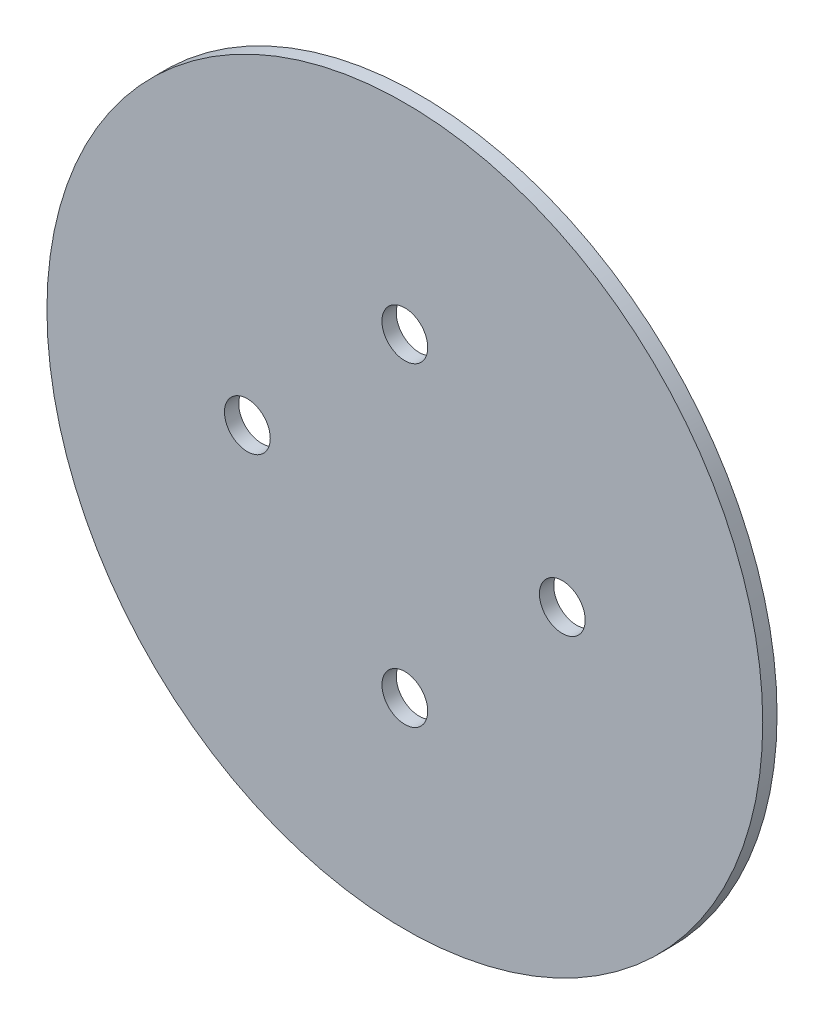
ISO-10303-21;
HEADER;
FILE_DESCRIPTION(('STEP AP214'),'2;1');
FILE_NAME('part.step','',(''),(''),'','','');
FILE_SCHEMA(('AUTOMOTIVE_DESIGN { 1 0 10303 214 1 1 1 1 }'));
ENDSEC;
DATA;
#1=APPLICATION_CONTEXT('core data for automotive mechanical design processes');
#2=APPLICATION_PROTOCOL_DEFINITION('international standard','automotive_design',2000,#1);
#3=PRODUCT_CONTEXT('',#1,'mechanical');
#4=PRODUCT('Part','Part','',(#3));
#5=PRODUCT_RELATED_PRODUCT_CATEGORY('part','',(#4));
#6=PRODUCT_DEFINITION_FORMATION('','',#4);
#7=PRODUCT_DEFINITION_CONTEXT('part definition',#1,'design');
#8=PRODUCT_DEFINITION('design','',#6,#7);
#9=PRODUCT_DEFINITION_SHAPE('','',#8);
#10=(LENGTH_UNIT() NAMED_UNIT(*) SI_UNIT(.MILLI.,.METRE.));
#11=(NAMED_UNIT(*) PLANE_ANGLE_UNIT() SI_UNIT($,.RADIAN.));
#12=(NAMED_UNIT(*) SI_UNIT($,.STERADIAN.) SOLID_ANGLE_UNIT());
#13=UNCERTAINTY_MEASURE_WITH_UNIT(LENGTH_MEASURE(1.E-05),#10,'distance_accuracy_value','');
#14=(GEOMETRIC_REPRESENTATION_CONTEXT(3) GLOBAL_UNCERTAINTY_ASSIGNED_CONTEXT((#13)) GLOBAL_UNIT_ASSIGNED_CONTEXT((#10,
#11,#12)) REPRESENTATION_CONTEXT('',''));
#15=CARTESIAN_POINT('',(0.,0.,0.));
#16=DIRECTION('',(0.,0.,1.));
#17=DIRECTION('',(1.,0.,0.));
#18=AXIS2_PLACEMENT_3D('',#15,#16,#17);
#19=CARTESIAN_POINT('',(0.,0.,1.));
#20=DIRECTION('',(0.,0.,1.));
#21=DIRECTION('',(1.,0.,0.));
#22=AXIS2_PLACEMENT_3D('',#19,#20,#21);
#23=PLANE('',#22);
#24=CARTESIAN_POINT('',(11.,0.,1.));
#25=DIRECTION('',(0.,0.,1.));
#26=DIRECTION('',(1.,0.,0.));
#27=AXIS2_PLACEMENT_3D('',#24,#25,#26);
#28=CIRCLE('',#27,1.6);
#29=CARTESIAN_POINT('',(12.6,0.,1.));
#30=VERTEX_POINT('',#29);
#31=EDGE_CURVE('E71',#30,#30,#28,.T.);
#32=ORIENTED_EDGE('',*,*,#31,.F.);
#33=EDGE_LOOP('',(#32));
#34=FACE_BOUND('',#33,.T.);
#35=CARTESIAN_POINT('',(-11.,0.,1.));
#36=DIRECTION('',(0.,0.,1.));
#37=DIRECTION('',(1.,0.,0.));
#38=AXIS2_PLACEMENT_3D('',#35,#36,#37);
#39=CIRCLE('',#38,1.6);
#40=CARTESIAN_POINT('',(-9.4,0.,1.));
#41=VERTEX_POINT('',#40);
#42=EDGE_CURVE('E58',#41,#41,#39,.T.);
#43=ORIENTED_EDGE('',*,*,#42,.F.);
#44=EDGE_LOOP('',(#43));
#45=FACE_BOUND('',#44,.T.);
#46=CARTESIAN_POINT('',(0.,0.,1.));
#47=DIRECTION('',(0.,0.,1.));
#48=DIRECTION('',(1.,0.,0.));
#49=AXIS2_PLACEMENT_3D('',#46,#47,#48);
#50=CIRCLE('',#49,25.);
#51=CARTESIAN_POINT('',(25.,0.,1.));
#52=VERTEX_POINT('',#51);
#53=EDGE_CURVE('E10',#52,#52,#50,.T.);
#54=ORIENTED_EDGE('',*,*,#53,.T.);
#55=EDGE_LOOP('',(#54));
#56=FACE_BOUND('',#55,.T.);
#57=CARTESIAN_POINT('',(0.,11.,1.));
#58=DIRECTION('',(0.,0.,1.));
#59=DIRECTION('',(1.,0.,0.));
#60=AXIS2_PLACEMENT_3D('',#57,#58,#59);
#61=CIRCLE('',#60,1.6);
#62=CARTESIAN_POINT('',(1.60000000000004,11.,1.));
#63=VERTEX_POINT('',#62);
#64=EDGE_CURVE('E64',#63,#63,#61,.T.);
#65=ORIENTED_EDGE('',*,*,#64,.F.);
#66=EDGE_LOOP('',(#65));
#67=FACE_BOUND('',#66,.T.);
#68=CARTESIAN_POINT('',(-1.15218884181823E-13,-11.,1.));
#69=DIRECTION('',(0.,0.,1.));
#70=DIRECTION('',(1.,0.,0.));
#71=AXIS2_PLACEMENT_3D('',#68,#69,#70);
#72=CIRCLE('',#71,1.6);
#73=CARTESIAN_POINT('',(1.59999999999989,-11.,1.));
#74=VERTEX_POINT('',#73);
#75=EDGE_CURVE('E78',#74,#74,#72,.T.);
#76=ORIENTED_EDGE('',*,*,#75,.F.);
#77=EDGE_LOOP('',(#76));
#78=FACE_BOUND('',#77,.T.);
#79=ADVANCED_FACE('F43',(#34,#45,#56,#67,#78),#23,.T.);
#80=CARTESIAN_POINT('',(0.,0.,0.));
#81=DIRECTION('',(0.,0.,1.));
#82=DIRECTION('',(1.,0.,0.));
#83=AXIS2_PLACEMENT_3D('',#80,#81,#82);
#84=PLANE('',#83);
#85=CARTESIAN_POINT('',(0.,0.,0.));
#86=DIRECTION('',(0.,0.,1.));
#87=DIRECTION('',(1.,0.,0.));
#88=AXIS2_PLACEMENT_3D('',#85,#86,#87);
#89=CIRCLE('',#88,25.);
#90=CARTESIAN_POINT('',(25.,0.,0.));
#91=VERTEX_POINT('',#90);
#92=EDGE_CURVE('E47',#91,#91,#89,.T.);
#93=ORIENTED_EDGE('',*,*,#92,.F.);
#94=EDGE_LOOP('',(#93));
#95=FACE_BOUND('',#94,.T.);
#96=CARTESIAN_POINT('',(-11.,0.,0.));
#97=DIRECTION('',(0.,0.,1.));
#98=DIRECTION('',(1.,0.,0.));
#99=AXIS2_PLACEMENT_3D('',#96,#97,#98);
#100=CIRCLE('',#99,1.6);
#101=CARTESIAN_POINT('',(-9.4,0.,0.));
#102=VERTEX_POINT('',#101);
#103=EDGE_CURVE('E60',#102,#102,#100,.T.);
#104=ORIENTED_EDGE('',*,*,#103,.T.);
#105=EDGE_LOOP('',(#104));
#106=FACE_BOUND('',#105,.T.);
#107=CARTESIAN_POINT('',(0.,11.,0.));
#108=DIRECTION('',(0.,0.,1.));
#109=DIRECTION('',(1.,0.,0.));
#110=AXIS2_PLACEMENT_3D('',#107,#108,#109);
#111=CIRCLE('',#110,1.6);
#112=CARTESIAN_POINT('',(1.60000000000004,11.,0.));
#113=VERTEX_POINT('',#112);
#114=EDGE_CURVE('E67',#113,#113,#111,.T.);
#115=ORIENTED_EDGE('',*,*,#114,.T.);
#116=EDGE_LOOP('',(#115));
#117=FACE_BOUND('',#116,.T.);
#118=CARTESIAN_POINT('',(11.,0.,0.));
#119=DIRECTION('',(0.,0.,1.));
#120=DIRECTION('',(1.,0.,0.));
#121=AXIS2_PLACEMENT_3D('',#118,#119,#120);
#122=CIRCLE('',#121,1.6);
#123=CARTESIAN_POINT('',(12.6,0.,0.));
#124=VERTEX_POINT('',#123);
#125=EDGE_CURVE('E74',#124,#124,#122,.T.);
#126=ORIENTED_EDGE('',*,*,#125,.T.);
#127=EDGE_LOOP('',(#126));
#128=FACE_BOUND('',#127,.T.);
#129=CARTESIAN_POINT('',(-1.15218884181823E-13,-11.,0.));
#130=DIRECTION('',(0.,0.,1.));
#131=DIRECTION('',(1.,0.,0.));
#132=AXIS2_PLACEMENT_3D('',#129,#130,#131);
#133=CIRCLE('',#132,1.6);
#134=CARTESIAN_POINT('',(1.59999999999989,-11.,0.));
#135=VERTEX_POINT('',#134);
#136=EDGE_CURVE('E82',#135,#135,#133,.T.);
#137=ORIENTED_EDGE('',*,*,#136,.T.);
#138=EDGE_LOOP('',(#137));
#139=FACE_BOUND('',#138,.T.);
#140=ADVANCED_FACE('F94',(#95,#106,#117,#128,#139),#84,.F.);
#141=CARTESIAN_POINT('',(0.,0.,1.));
#142=DIRECTION('',(0.,0.,-1.));
#143=DIRECTION('',(-1.,0.,0.));
#144=AXIS2_PLACEMENT_3D('',#141,#142,#143);
#145=CYLINDRICAL_SURFACE('',#144,25.);
#146=ORIENTED_EDGE('',*,*,#53,.F.);
#147=EDGE_LOOP('',(#146));
#148=FACE_BOUND('',#147,.T.);
#149=ORIENTED_EDGE('',*,*,#92,.T.);
#150=EDGE_LOOP('',(#149));
#151=FACE_BOUND('',#150,.T.);
#152=ADVANCED_FACE('F45',(#148,#151),#145,.T.);
#153=CARTESIAN_POINT('',(-11.,0.,1.));
#154=DIRECTION('',(0.,0.,-1.));
#155=DIRECTION('',(-1.,0.,0.));
#156=AXIS2_PLACEMENT_3D('',#153,#154,#155);
#157=CYLINDRICAL_SURFACE('',#156,1.6);
#158=ORIENTED_EDGE('',*,*,#42,.T.);
#159=EDGE_LOOP('',(#158));
#160=FACE_BOUND('',#159,.T.);
#161=ORIENTED_EDGE('',*,*,#103,.F.);
#162=EDGE_LOOP('',(#161));
#163=FACE_BOUND('',#162,.T.);
#164=ADVANCED_FACE('F103',(#160,#163),#157,.F.);
#165=CARTESIAN_POINT('',(0.,11.,1.));
#166=DIRECTION('',(0.,0.,-1.));
#167=DIRECTION('',(-1.,0.,0.));
#168=AXIS2_PLACEMENT_3D('',#165,#166,#167);
#169=CYLINDRICAL_SURFACE('',#168,1.6);
#170=ORIENTED_EDGE('',*,*,#64,.T.);
#171=EDGE_LOOP('',(#170));
#172=FACE_BOUND('',#171,.T.);
#173=ORIENTED_EDGE('',*,*,#114,.F.);
#174=EDGE_LOOP('',(#173));
#175=FACE_BOUND('',#174,.T.);
#176=ADVANCED_FACE('F106',(#172,#175),#169,.F.);
#177=CARTESIAN_POINT('',(11.,0.,1.));
#178=DIRECTION('',(0.,0.,-1.));
#179=DIRECTION('',(-1.,0.,0.));
#180=AXIS2_PLACEMENT_3D('',#177,#178,#179);
#181=CYLINDRICAL_SURFACE('',#180,1.6);
#182=ORIENTED_EDGE('',*,*,#31,.T.);
#183=EDGE_LOOP('',(#182));
#184=FACE_BOUND('',#183,.T.);
#185=ORIENTED_EDGE('',*,*,#125,.F.);
#186=EDGE_LOOP('',(#185));
#187=FACE_BOUND('',#186,.T.);
#188=ADVANCED_FACE('F110',(#184,#187),#181,.F.);
#189=CARTESIAN_POINT('',(-1.15218884181823E-13,-11.,1.));
#190=DIRECTION('',(0.,0.,-1.));
#191=DIRECTION('',(-1.,0.,0.));
#192=AXIS2_PLACEMENT_3D('',#189,#190,#191);
#193=CYLINDRICAL_SURFACE('',#192,1.6);
#194=ORIENTED_EDGE('',*,*,#75,.T.);
#195=EDGE_LOOP('',(#194));
#196=FACE_BOUND('',#195,.T.);
#197=ORIENTED_EDGE('',*,*,#136,.F.);
#198=EDGE_LOOP('',(#197));
#199=FACE_BOUND('',#198,.T.);
#200=ADVANCED_FACE('F90',(#196,#199),#193,.F.);
#201=CLOSED_SHELL('',(#79,#140,#152,#164,#176,#188,#200));
#202=MANIFOLD_SOLID_BREP('B2',#201);
#203=ADVANCED_BREP_SHAPE_REPRESENTATION('',(#18,#202),#14);
#204=SHAPE_DEFINITION_REPRESENTATION(#9,#203);
ENDSEC;
END-ISO-10303-21;
